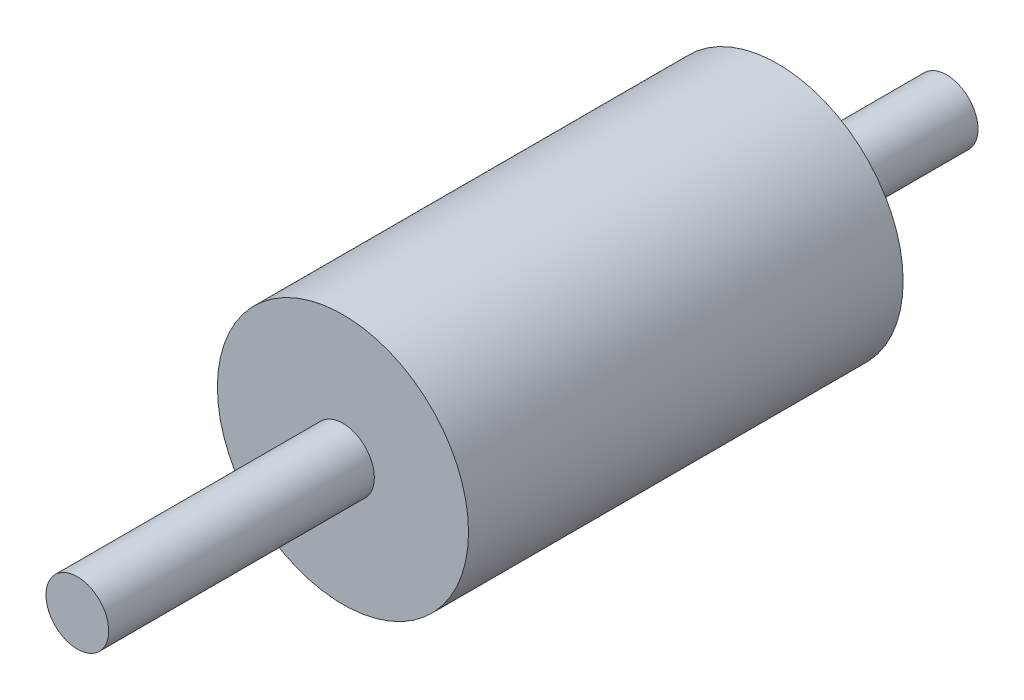
ISO-10303-21;
HEADER;
FILE_DESCRIPTION(('STEP AP214'),'2;1');
FILE_NAME('part.step','',(''),(''),'','','');
FILE_SCHEMA(('AUTOMOTIVE_DESIGN { 1 0 10303 214 1 1 1 1 }'));
ENDSEC;
DATA;
#1=APPLICATION_CONTEXT('core data for automotive mechanical design processes');
#2=APPLICATION_PROTOCOL_DEFINITION('international standard','automotive_design',2000,#1);
#3=PRODUCT_CONTEXT('',#1,'mechanical');
#4=PRODUCT('Part','Part','',(#3));
#5=PRODUCT_RELATED_PRODUCT_CATEGORY('part','',(#4));
#6=PRODUCT_DEFINITION_FORMATION('','',#4);
#7=PRODUCT_DEFINITION_CONTEXT('part definition',#1,'design');
#8=PRODUCT_DEFINITION('design','',#6,#7);
#9=PRODUCT_DEFINITION_SHAPE('','',#8);
#10=(LENGTH_UNIT() NAMED_UNIT(*) SI_UNIT(.MILLI.,.METRE.));
#11=(NAMED_UNIT(*) PLANE_ANGLE_UNIT() SI_UNIT($,.RADIAN.));
#12=(NAMED_UNIT(*) SI_UNIT($,.STERADIAN.) SOLID_ANGLE_UNIT());
#13=UNCERTAINTY_MEASURE_WITH_UNIT(LENGTH_MEASURE(1.E-05),#10,'distance_accuracy_value','');
#14=(GEOMETRIC_REPRESENTATION_CONTEXT(3) GLOBAL_UNCERTAINTY_ASSIGNED_CONTEXT((#13)) GLOBAL_UNIT_ASSIGNED_CONTEXT((#10,
#11,#12)) REPRESENTATION_CONTEXT('',''));
#15=CARTESIAN_POINT('',(0.,0.,0.));
#16=DIRECTION('',(0.,0.,1.));
#17=DIRECTION('',(1.,0.,0.));
#18=AXIS2_PLACEMENT_3D('',#15,#16,#17);
#19=CARTESIAN_POINT('',(0.,0.,-8.));
#20=DIRECTION('',(0.,0.,1.));
#21=DIRECTION('',(1.,0.,0.));
#22=AXIS2_PLACEMENT_3D('',#19,#20,#21);
#23=CYLINDRICAL_SURFACE('',#22,0.65);
#24=CARTESIAN_POINT('',(0.,0.,-8.));
#25=DIRECTION('',(0.,0.,1.));
#26=DIRECTION('',(1.,0.,0.));
#27=AXIS2_PLACEMENT_3D('',#24,#25,#26);
#28=CIRCLE('',#27,0.65);
#29=CARTESIAN_POINT('',(0.65,0.,-8.));
#30=VERTEX_POINT('',#29);
#31=EDGE_CURVE('E41',#30,#30,#28,.T.);
#32=ORIENTED_EDGE('',*,*,#31,.T.);
#33=EDGE_LOOP('',(#32));
#34=FACE_BOUND('',#33,.T.);
#35=CARTESIAN_POINT('',(0.,0.,-4.5));
#36=DIRECTION('',(0.,0.,1.));
#37=DIRECTION('',(1.,0.,0.));
#38=AXIS2_PLACEMENT_3D('',#35,#36,#37);
#39=CIRCLE('',#38,0.65);
#40=CARTESIAN_POINT('',(0.65,0.,-4.5));
#41=VERTEX_POINT('',#40);
#42=EDGE_CURVE('E37',#41,#41,#39,.F.);
#43=ORIENTED_EDGE('',*,*,#42,.T.);
#44=EDGE_LOOP('',(#43));
#45=FACE_BOUND('',#44,.T.);
#46=ADVANCED_FACE('F33',(#34,#45),#23,.T.);
#47=CARTESIAN_POINT('',(0.,-1.57142135623731,-8.));
#48=DIRECTION('',(0.,0.,1.));
#49=DIRECTION('',(1.,0.,0.));
#50=AXIS2_PLACEMENT_3D('',#47,#48,#49);
#51=PLANE('',#50);
#52=ORIENTED_EDGE('',*,*,#31,.F.);
#53=EDGE_LOOP('',(#52));
#54=FACE_BOUND('',#53,.T.);
#55=ADVANCED_FACE('F62',(#54),#51,.F.);
#56=CARTESIAN_POINT('',(0.,0.,-4.5));
#57=DIRECTION('',(0.,0.,1.));
#58=DIRECTION('',(1.,0.,0.));
#59=AXIS2_PLACEMENT_3D('',#56,#57,#58);
#60=CYLINDRICAL_SURFACE('',#59,2.6);
#61=CARTESIAN_POINT('',(0.,0.,-4.5));
#62=DIRECTION('',(0.,0.,1.));
#63=DIRECTION('',(1.,0.,0.));
#64=AXIS2_PLACEMENT_3D('',#61,#62,#63);
#65=CIRCLE('',#64,2.6);
#66=CARTESIAN_POINT('',(2.6,0.,-4.5));
#67=VERTEX_POINT('',#66);
#68=EDGE_CURVE('E50',#67,#67,#65,.T.);
#69=ORIENTED_EDGE('',*,*,#68,.T.);
#70=EDGE_LOOP('',(#69));
#71=FACE_BOUND('',#70,.T.);
#72=CARTESIAN_POINT('',(0.,0.,4.5));
#73=DIRECTION('',(0.,0.,1.));
#74=DIRECTION('',(1.,0.,0.));
#75=AXIS2_PLACEMENT_3D('',#72,#73,#74);
#76=CIRCLE('',#75,2.6);
#77=CARTESIAN_POINT('',(2.6,0.,4.5));
#78=VERTEX_POINT('',#77);
#79=EDGE_CURVE('E53',#78,#78,#76,.T.);
#80=ORIENTED_EDGE('',*,*,#79,.F.);
#81=EDGE_LOOP('',(#80));
#82=FACE_BOUND('',#81,.T.);
#83=ADVANCED_FACE('F59',(#71,#82),#60,.T.);
#84=CARTESIAN_POINT('',(0.,-5.86142135623731,-4.5));
#85=DIRECTION('',(0.,0.,1.));
#86=DIRECTION('',(1.,0.,0.));
#87=AXIS2_PLACEMENT_3D('',#84,#85,#86);
#88=PLANE('',#87);
#89=ORIENTED_EDGE('',*,*,#42,.F.);
#90=EDGE_LOOP('',(#89));
#91=FACE_BOUND('',#90,.T.);
#92=ORIENTED_EDGE('',*,*,#68,.F.);
#93=EDGE_LOOP('',(#92));
#94=FACE_BOUND('',#93,.T.);
#95=ADVANCED_FACE('F61',(#91,#94),#88,.F.);
#96=CARTESIAN_POINT('',(0.,-5.86142135623731,4.5));
#97=DIRECTION('',(0.,0.,1.));
#98=DIRECTION('',(1.,0.,0.));
#99=AXIS2_PLACEMENT_3D('',#96,#97,#98);
#100=PLANE('',#99);
#101=CARTESIAN_POINT('',(0.,0.,4.5));
#102=DIRECTION('',(0.,0.,1.));
#103=DIRECTION('',(1.,0.,0.));
#104=AXIS2_PLACEMENT_3D('',#101,#102,#103);
#105=CIRCLE('',#104,0.65);
#106=CARTESIAN_POINT('',(0.65,0.,4.5));
#107=VERTEX_POINT('',#106);
#108=EDGE_CURVE('E10',#107,#107,#105,.F.);
#109=ORIENTED_EDGE('',*,*,#108,.T.);
#110=EDGE_LOOP('',(#109));
#111=FACE_BOUND('',#110,.T.);
#112=ORIENTED_EDGE('',*,*,#79,.T.);
#113=EDGE_LOOP('',(#112));
#114=FACE_BOUND('',#113,.T.);
#115=ADVANCED_FACE('F57',(#111,#114),#100,.T.);
#116=CARTESIAN_POINT('',(0.,-1.57142135623731,10.));
#117=DIRECTION('',(0.,0.,1.));
#118=DIRECTION('',(1.,0.,0.));
#119=AXIS2_PLACEMENT_3D('',#116,#117,#118);
#120=PLANE('',#119);
#121=CARTESIAN_POINT('',(0.,0.,10.));
#122=DIRECTION('',(0.,0.,1.));
#123=DIRECTION('',(1.,0.,0.));
#124=AXIS2_PLACEMENT_3D('',#121,#122,#123);
#125=CIRCLE('',#124,0.65);
#126=CARTESIAN_POINT('',(0.65,0.,10.));
#127=VERTEX_POINT('',#126);
#128=EDGE_CURVE('E45',#127,#127,#125,.T.);
#129=ORIENTED_EDGE('',*,*,#128,.T.);
#130=EDGE_LOOP('',(#129));
#131=FACE_BOUND('',#130,.T.);
#132=ADVANCED_FACE('F79',(#131),#120,.T.);
#133=ORIENTED_EDGE('',*,*,#108,.F.);
#134=EDGE_LOOP('',(#133));
#135=FACE_BOUND('',#134,.T.);
#136=ORIENTED_EDGE('',*,*,#128,.F.);
#137=EDGE_LOOP('',(#136));
#138=FACE_BOUND('',#137,.T.);
#139=ADVANCED_FACE('F35',(#135,#138),#23,.T.);
#140=CLOSED_SHELL('',(#46,#55,#83,#95,#115,#132,#139));
#141=MANIFOLD_SOLID_BREP('B2',#140);
#142=ADVANCED_BREP_SHAPE_REPRESENTATION('',(#18,#141),#14);
#143=SHAPE_DEFINITION_REPRESENTATION(#9,#142);
ENDSEC;
END-ISO-10303-21;
